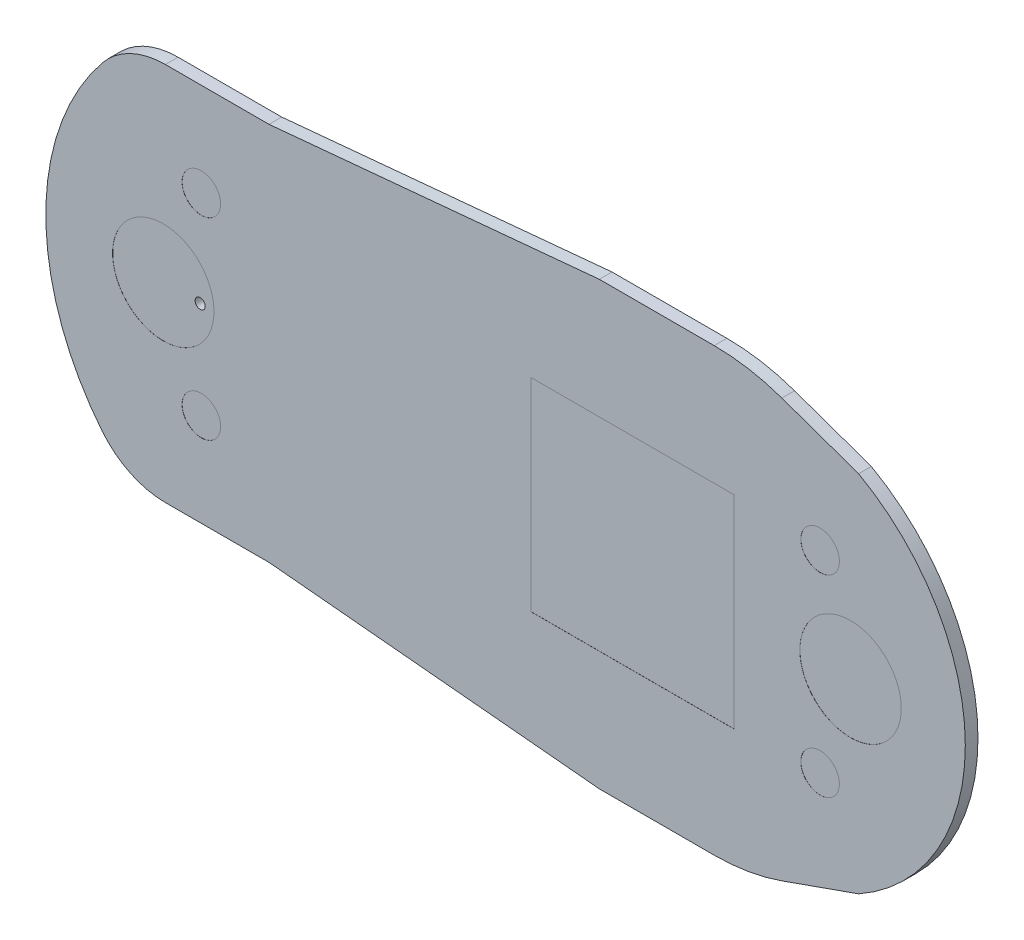
ISO-10303-21;
HEADER;
FILE_DESCRIPTION(('STEP AP214'),'2;1');
FILE_NAME('part.step','',(''),(''),'','','');
FILE_SCHEMA(('AUTOMOTIVE_DESIGN { 1 0 10303 214 1 1 1 1 }'));
ENDSEC;
DATA;
#1=APPLICATION_CONTEXT('core data for automotive mechanical design processes');
#2=APPLICATION_PROTOCOL_DEFINITION('international standard','automotive_design',2000,#1);
#3=PRODUCT_CONTEXT('',#1,'mechanical');
#4=PRODUCT('Part','Part','',(#3));
#5=PRODUCT_RELATED_PRODUCT_CATEGORY('part','',(#4));
#6=PRODUCT_DEFINITION_FORMATION('','',#4);
#7=PRODUCT_DEFINITION_CONTEXT('part definition',#1,'design');
#8=PRODUCT_DEFINITION('design','',#6,#7);
#9=PRODUCT_DEFINITION_SHAPE('','',#8);
#10=(LENGTH_UNIT() NAMED_UNIT(*) SI_UNIT(.MILLI.,.METRE.));
#11=(NAMED_UNIT(*) PLANE_ANGLE_UNIT() SI_UNIT($,.RADIAN.));
#12=(NAMED_UNIT(*) SI_UNIT($,.STERADIAN.) SOLID_ANGLE_UNIT());
#13=UNCERTAINTY_MEASURE_WITH_UNIT(LENGTH_MEASURE(1.E-05),#10,'distance_accuracy_value','');
#14=(GEOMETRIC_REPRESENTATION_CONTEXT(3) GLOBAL_UNCERTAINTY_ASSIGNED_CONTEXT((#13)) GLOBAL_UNIT_ASSIGNED_CONTEXT((#10,
#11,#12)) REPRESENTATION_CONTEXT('',''));
#15=CARTESIAN_POINT('',(0.,0.,0.));
#16=DIRECTION('',(0.,0.,1.));
#17=DIRECTION('',(1.,0.,0.));
#18=AXIS2_PLACEMENT_3D('',#15,#16,#17);
#19=CARTESIAN_POINT('',(122.626549398508,-30.4550148476976,-35.39998));
#20=DIRECTION('',(0.,0.,-1.));
#21=DIRECTION('',(-1.,0.,0.));
#22=AXIS2_PLACEMENT_3D('',#19,#20,#21);
#23=PLANE('',#22);
#24=CARTESIAN_POINT('',(-47.0985980295692,-27.1779998942306,-35.39998));
#25=DIRECTION('',(0.,0.,1.));
#26=DIRECTION('',(-1.,0.,0.));
#27=AXIS2_PLACEMENT_3D('',#24,#25,#26);
#28=CIRCLE('',#27,20.32);
#29=CARTESIAN_POINT('',(-62.8887002896557,-39.9676469032717,-35.39998));
#30=VERTEX_POINT('',#29);
#31=CARTESIAN_POINT('',(-47.0985980295692,-47.4979998942169,-35.39998));
#32=VERTEX_POINT('',#31);
#33=EDGE_CURVE('E188',#30,#32,#28,.T.);
#34=ORIENTED_EDGE('',*,*,#33,.F.);
#35=CARTESIAN_POINT('',(-13.5446307268799,-1.36631209144207E-11,-35.39998));
#36=DIRECTION('',(0.,0.,-1.));
#37=DIRECTION('',(-1.,0.,0.));
#38=AXIS2_PLACEMENT_3D('',#35,#36,#37);
#39=CIRCLE('',#38,63.5);
#40=CARTESIAN_POINT('',(-62.8887002896584,39.9676469032465,-35.39998));
#41=VERTEX_POINT('',#40);
#42=EDGE_CURVE('E201',#30,#41,#39,.T.);
#43=ORIENTED_EDGE('',*,*,#42,.T.);
#44=CARTESIAN_POINT('',(-47.0985980295693,27.1779998942033,-35.39998));
#45=DIRECTION('',(0.,0.,1.));
#46=DIRECTION('',(-1.,0.,0.));
#47=AXIS2_PLACEMENT_3D('',#44,#45,#46);
#48=CIRCLE('',#47,20.32);
#49=CARTESIAN_POINT('',(-47.0985980295693,47.4979998942033,-35.39998));
#50=VERTEX_POINT('',#49);
#51=EDGE_CURVE('E217',#50,#41,#48,.T.);
#52=ORIENTED_EDGE('',*,*,#51,.F.);
#53=DIRECTION('',(1.,0.,0.));
#54=VECTOR('',#53,1.);
#55=CARTESIAN_POINT('',(-48.895,47.4979998942169,-35.39998));
#56=LINE('',#55,#54);
#57=CARTESIAN_POINT('',(-21.1455,47.4979998942169,-35.39998));
#58=VERTEX_POINT('',#57);
#59=EDGE_CURVE('E270',#50,#58,#56,.T.);
#60=ORIENTED_EDGE('',*,*,#59,.T.);
#61=DIRECTION('',(0.995634568949673,0.0933370511233257,0.));
#62=VECTOR('',#61,1.);
#63=CARTESIAN_POINT('',(-4.5981853524393,49.0492493198395,-35.39998));
#64=LINE('',#63,#62);
#65=CARTESIAN_POINT('',(61.5582408342434,55.2511691061693,-35.39998));
#66=VERTEX_POINT('',#65);
#67=EDGE_CURVE('E264',#58,#66,#64,.T.);
#68=ORIENTED_EDGE('',*,*,#67,.T.);
#69=DIRECTION('',(1.,0.,0.));
#70=VECTOR('',#69,1.);
#71=CARTESIAN_POINT('',(61.5582408342434,55.2511691061693,-35.39998));
#72=LINE('',#71,#70);
#73=CARTESIAN_POINT('',(90.3291359160554,55.2511691061693,-35.39998));
#74=VERTEX_POINT('',#73);
#75=EDGE_CURVE('E348',#66,#74,#72,.T.);
#76=ORIENTED_EDGE('',*,*,#75,.T.);
#77=CARTESIAN_POINT('',(90.3291359160554,4.45116910615567,-35.39998));
#78=DIRECTION('',(0.,0.,1.));
#79=DIRECTION('',(-1.,0.,0.));
#80=AXIS2_PLACEMENT_3D('',#77,#78,#79);
#81=CIRCLE('',#80,50.8);
#82=CARTESIAN_POINT('',(107.258186289215,52.3473824581842,-35.39998));
#83=VERTEX_POINT('',#82);
#84=EDGE_CURVE('E76',#83,#74,#81,.T.);
#85=ORIENTED_EDGE('',*,*,#84,.F.);
#86=DIRECTION('',(0.942838845512373,-0.333249023093687,0.));
#87=VECTOR('',#86,1.);
#88=CARTESIAN_POINT('',(107.258186289215,52.3473824581842,-35.39998));
#89=LINE('',#88,#87);
#90=CARTESIAN_POINT('',(126.475317140702,45.5550338893877,-35.39998));
#91=VERTEX_POINT('',#90);
#92=EDGE_CURVE('E207',#83,#91,#89,.T.);
#93=ORIENTED_EDGE('',*,*,#92,.T.);
#94=CARTESIAN_POINT('',(101.009015662043,-1.35996332633924E-11,-35.39998));
#95=DIRECTION('',(0.,0.,-1.));
#96=DIRECTION('',(-1.,0.,0.));
#97=AXIS2_PLACEMENT_3D('',#94,#95,#96);
#98=CIRCLE('',#97,52.1899762757795);
#99=CARTESIAN_POINT('',(126.475317140702,-45.5550338894149,-35.39998));
#100=VERTEX_POINT('',#99);
#101=EDGE_CURVE('E402',#91,#100,#98,.T.);
#102=ORIENTED_EDGE('',*,*,#101,.T.);
#103=DIRECTION('',(-0.942838845512372,-0.333249023093688,0.));
#104=VECTOR('',#103,1.);
#105=CARTESIAN_POINT('',(126.475317140702,-45.5550338894149,-35.39998));
#106=LINE('',#105,#104);
#107=CARTESIAN_POINT('',(107.258186289215,-52.3473824582114,-35.39998));
#108=VERTEX_POINT('',#107);
#109=EDGE_CURVE('E375',#100,#108,#106,.T.);
#110=ORIENTED_EDGE('',*,*,#109,.T.);
#111=CARTESIAN_POINT('',(90.3291359160555,-4.45116910618289,-35.39998));
#112=DIRECTION('',(0.,0.,1.));
#113=DIRECTION('',(-1.,0.,0.));
#114=AXIS2_PLACEMENT_3D('',#111,#112,#113);
#115=CIRCLE('',#114,50.8);
#116=CARTESIAN_POINT('',(90.3291359160555,-55.2511691061829,-35.39998));
#117=VERTEX_POINT('',#116);
#118=EDGE_CURVE('E225',#117,#108,#115,.T.);
#119=ORIENTED_EDGE('',*,*,#118,.F.);
#120=DIRECTION('',(1.,0.,0.));
#121=VECTOR('',#120,1.);
#122=CARTESIAN_POINT('',(61.5582408342434,-55.2511691061693,-35.39998));
#123=LINE('',#122,#121);
#124=CARTESIAN_POINT('',(61.5582408342434,-55.2511691061693,-35.39998));
#125=VERTEX_POINT('',#124);
#126=EDGE_CURVE('E236',#125,#117,#123,.T.);
#127=ORIENTED_EDGE('',*,*,#126,.F.);
#128=DIRECTION('',(0.995634568949673,-0.0933370511233257,0.));
#129=VECTOR('',#128,1.);
#130=CARTESIAN_POINT('',(-4.5981853524393,-49.0492493198395,-35.39998));
#131=LINE('',#130,#129);
#132=CARTESIAN_POINT('',(-21.1455,-47.4979998942169,-35.39998));
#133=VERTEX_POINT('',#132);
#134=EDGE_CURVE('E258',#133,#125,#131,.T.);
#135=ORIENTED_EDGE('',*,*,#134,.F.);
#136=DIRECTION('',(1.,0.,0.));
#137=VECTOR('',#136,1.);
#138=CARTESIAN_POINT('',(-27.94,-47.4979998942169,-35.39998));
#139=LINE('',#138,#137);
#140=EDGE_CURVE('E275',#32,#133,#139,.T.);
#141=ORIENTED_EDGE('',*,*,#140,.F.);
#142=EDGE_LOOP('',(#34,#43,#52,#60,#68,#76,#85,#93,#102,#110,#119,#127,#135,#141));
#143=FACE_BOUND('',#142,.T.);
#144=ADVANCED_FACE('F52',(#143),#23,.T.);
#145=CARTESIAN_POINT('',(122.626549398508,-30.4550148476976,-32.22498));
#146=DIRECTION('',(0.,0.,-1.));
#147=DIRECTION('',(-1.,0.,0.));
#148=AXIS2_PLACEMENT_3D('',#145,#146,#147);
#149=PLANE('',#148);
#150=CARTESIAN_POINT('',(-13.5446307268799,-1.36631209144207E-11,-32.22498));
#151=DIRECTION('',(0.,0.,-1.));
#152=DIRECTION('',(-1.,0.,0.));
#153=AXIS2_PLACEMENT_3D('',#150,#151,#152);
#154=CIRCLE('',#153,63.5);
#155=CARTESIAN_POINT('',(-62.8887002896584,39.9676469032465,-32.22498));
#156=VERTEX_POINT('',#155);
#157=CARTESIAN_POINT('',(-62.8887002896557,-39.9676469032718,-32.22498));
#158=VERTEX_POINT('',#157);
#159=EDGE_CURVE('E191',#156,#158,#154,.F.);
#160=ORIENTED_EDGE('',*,*,#159,.T.);
#161=CARTESIAN_POINT('',(-47.0985980295692,-27.1779998942306,-32.22498));
#162=DIRECTION('',(0.,0.,1.));
#163=DIRECTION('',(-1.,0.,0.));
#164=AXIS2_PLACEMENT_3D('',#161,#162,#163);
#165=CIRCLE('',#164,20.32);
#166=CARTESIAN_POINT('',(-47.0985980295692,-47.4979998942306,-32.22498));
#167=VERTEX_POINT('',#166);
#168=EDGE_CURVE('E178',#158,#167,#165,.T.);
#169=ORIENTED_EDGE('',*,*,#168,.T.);
#170=DIRECTION('',(1.,0.,0.));
#171=VECTOR('',#170,1.);
#172=CARTESIAN_POINT('',(-27.94,-47.4979998942169,-32.22498));
#173=LINE('',#172,#171);
#174=CARTESIAN_POINT('',(-21.1455,-47.4979998942169,-32.22498));
#175=VERTEX_POINT('',#174);
#176=EDGE_CURVE('E259',#167,#175,#173,.T.);
#177=ORIENTED_EDGE('',*,*,#176,.T.);
#178=DIRECTION('',(0.995634568949673,-0.0933370511233257,0.));
#179=VECTOR('',#178,1.);
#180=CARTESIAN_POINT('',(-4.5981853524393,-49.0492493198395,-32.22498));
#181=LINE('',#180,#179);
#182=CARTESIAN_POINT('',(61.5582408342434,-55.2511691061693,-32.22498));
#183=VERTEX_POINT('',#182);
#184=EDGE_CURVE('E255',#175,#183,#181,.T.);
#185=ORIENTED_EDGE('',*,*,#184,.T.);
#186=DIRECTION('',(-1.,0.,0.));
#187=VECTOR('',#186,1.);
#188=CARTESIAN_POINT('',(61.5582408342434,-55.2511691061693,-32.22498));
#189=LINE('',#188,#187);
#190=CARTESIAN_POINT('',(90.3291359160555,-55.2511691061693,-32.22498));
#191=VERTEX_POINT('',#190);
#192=EDGE_CURVE('E61',#191,#183,#189,.T.);
#193=ORIENTED_EDGE('',*,*,#192,.F.);
#194=CARTESIAN_POINT('',(90.3291359160555,-4.45116910618289,-32.22498));
#195=DIRECTION('',(0.,0.,1.));
#196=DIRECTION('',(-1.,0.,0.));
#197=AXIS2_PLACEMENT_3D('',#194,#195,#196);
#198=CIRCLE('',#197,50.8);
#199=CARTESIAN_POINT('',(107.258186289215,-52.3473824582114,-32.22498));
#200=VERTEX_POINT('',#199);
#201=EDGE_CURVE('E68',#191,#200,#198,.T.);
#202=ORIENTED_EDGE('',*,*,#201,.T.);
#203=DIRECTION('',(0.942838845512372,0.333249023093688,0.));
#204=VECTOR('',#203,1.);
#205=CARTESIAN_POINT('',(126.475317140702,-45.5550338894149,-32.22498));
#206=LINE('',#205,#204);
#207=CARTESIAN_POINT('',(126.475317140702,-45.5550338894149,-32.22498));
#208=VERTEX_POINT('',#207);
#209=EDGE_CURVE('E383',#200,#208,#206,.T.);
#210=ORIENTED_EDGE('',*,*,#209,.T.);
#211=CARTESIAN_POINT('',(101.009015662043,-1.35996332633924E-11,-32.22498));
#212=DIRECTION('',(0.,0.,-1.));
#213=DIRECTION('',(-1.,0.,0.));
#214=AXIS2_PLACEMENT_3D('',#211,#212,#213);
#215=CIRCLE('',#214,52.1899762757795);
#216=CARTESIAN_POINT('',(126.475317140702,45.5550338893877,-32.22498));
#217=VERTEX_POINT('',#216);
#218=EDGE_CURVE('E384',#208,#217,#215,.F.);
#219=ORIENTED_EDGE('',*,*,#218,.T.);
#220=DIRECTION('',(-0.942838845512373,0.333249023093687,0.));
#221=VECTOR('',#220,1.);
#222=CARTESIAN_POINT('',(107.258186289215,52.3473824581842,-32.22498));
#223=LINE('',#222,#221);
#224=CARTESIAN_POINT('',(107.258186289215,52.3473824581842,-32.22498));
#225=VERTEX_POINT('',#224);
#226=EDGE_CURVE('E365',#217,#225,#223,.T.);
#227=ORIENTED_EDGE('',*,*,#226,.T.);
#228=CARTESIAN_POINT('',(90.3291359160554,4.45116910615567,-32.22498));
#229=DIRECTION('',(0.,0.,1.));
#230=DIRECTION('',(-1.,0.,0.));
#231=AXIS2_PLACEMENT_3D('',#228,#229,#230);
#232=CIRCLE('',#231,50.8);
#233=CARTESIAN_POINT('',(90.3291359160554,55.2511691061557,-32.22498));
#234=VERTEX_POINT('',#233);
#235=EDGE_CURVE('E361',#225,#234,#232,.T.);
#236=ORIENTED_EDGE('',*,*,#235,.T.);
#237=DIRECTION('',(-1.,0.,0.));
#238=VECTOR('',#237,1.);
#239=CARTESIAN_POINT('',(61.5582408342434,55.2511691061693,-32.22498));
#240=LINE('',#239,#238);
#241=CARTESIAN_POINT('',(61.5582408342434,55.2511691061693,-32.22498));
#242=VERTEX_POINT('',#241);
#243=EDGE_CURVE('E242',#234,#242,#240,.T.);
#244=ORIENTED_EDGE('',*,*,#243,.T.);
#245=DIRECTION('',(0.995634568949673,0.0933370511233257,0.));
#246=VECTOR('',#245,1.);
#247=CARTESIAN_POINT('',(-4.5981853524393,49.0492493198395,-32.22498));
#248=LINE('',#247,#246);
#249=CARTESIAN_POINT('',(-21.1455,47.4979998942169,-32.22498));
#250=VERTEX_POINT('',#249);
#251=EDGE_CURVE('E260',#250,#242,#248,.T.);
#252=ORIENTED_EDGE('',*,*,#251,.F.);
#253=DIRECTION('',(1.,0.,0.));
#254=VECTOR('',#253,1.);
#255=CARTESIAN_POINT('',(-48.895,47.4979998942169,-32.22498));
#256=LINE('',#255,#254);
#257=CARTESIAN_POINT('',(-47.0985980295693,47.4979998942169,-32.22498));
#258=VERTEX_POINT('',#257);
#259=EDGE_CURVE('E269',#258,#250,#256,.T.);
#260=ORIENTED_EDGE('',*,*,#259,.F.);
#261=CARTESIAN_POINT('',(-47.0985980295693,27.1779998942033,-32.22498));
#262=DIRECTION('',(0.,0.,1.));
#263=DIRECTION('',(-1.,0.,0.));
#264=AXIS2_PLACEMENT_3D('',#261,#262,#263);
#265=CIRCLE('',#264,20.32);
#266=EDGE_CURVE('E194',#258,#156,#265,.T.);
#267=ORIENTED_EDGE('',*,*,#266,.T.);
#268=EDGE_LOOP('',(#160,#169,#177,#185,#193,#202,#210,#219,#227,#236,#244,#252,#260,#267));
#269=FACE_BOUND('',#268,.T.);
#270=CARTESIAN_POINT('',(-38.1,24.13,-32.22498));
#271=DIRECTION('',(0.,0.,1.));
#272=DIRECTION('',(1.,0.,0.));
#273=AXIS2_PLACEMENT_3D('',#270,#271,#272);
#274=CIRCLE('',#273,4.82599999999999);
#275=CARTESIAN_POINT('',(-33.274,24.13,-32.22498));
#276=VERTEX_POINT('',#275);
#277=EDGE_CURVE('E296',#276,#276,#274,.T.);
#278=ORIENTED_EDGE('',*,*,#277,.F.);
#279=EDGE_LOOP('',(#278));
#280=FACE_BOUND('',#279,.T.);
#281=CARTESIAN_POINT('',(124.46,0.,-32.22498));
#282=DIRECTION('',(0.,0.,1.));
#283=DIRECTION('',(1.,0.,0.));
#284=AXIS2_PLACEMENT_3D('',#281,#282,#283);
#285=CIRCLE('',#284,12.7);
#286=CARTESIAN_POINT('',(137.16,0.,-32.22498));
#287=VERTEX_POINT('',#286);
#288=EDGE_CURVE('E288',#287,#287,#285,.T.);
#289=ORIENTED_EDGE('',*,*,#288,.F.);
#290=EDGE_LOOP('',(#289));
#291=FACE_BOUND('',#290,.T.);
#292=CARTESIAN_POINT('',(-47.625,0.,-32.22498));
#293=DIRECTION('',(0.,0.,1.));
#294=DIRECTION('',(1.,0.,0.));
#295=AXIS2_PLACEMENT_3D('',#292,#293,#294);
#296=CIRCLE('',#295,12.7);
#297=CARTESIAN_POINT('',(-34.925,0.,-32.22498));
#298=VERTEX_POINT('',#297);
#299=EDGE_CURVE('E281',#298,#298,#296,.T.);
#300=ORIENTED_EDGE('',*,*,#299,.F.);
#301=EDGE_LOOP('',(#300));
#302=FACE_BOUND('',#301,.T.);
#303=DIRECTION('',(-1.,0.,0.));
#304=VECTOR('',#303,1.);
#305=CARTESIAN_POINT('',(44.45,25.4,-32.22498));
#306=LINE('',#305,#304);
#307=CARTESIAN_POINT('',(95.25,25.4,-32.22498));
#308=VERTEX_POINT('',#307);
#309=CARTESIAN_POINT('',(44.45,25.4,-32.22498));
#310=VERTEX_POINT('',#309);
#311=EDGE_CURVE('E329',#308,#310,#306,.T.);
#312=ORIENTED_EDGE('',*,*,#311,.F.);
#313=DIRECTION('',(0.,1.,0.));
#314=VECTOR('',#313,1.);
#315=CARTESIAN_POINT('',(95.25,-25.4,-32.22498));
#316=LINE('',#315,#314);
#317=CARTESIAN_POINT('',(95.25,-25.4,-32.22498));
#318=VERTEX_POINT('',#317);
#319=EDGE_CURVE('E312',#318,#308,#316,.T.);
#320=ORIENTED_EDGE('',*,*,#319,.F.);
#321=DIRECTION('',(1.,0.,0.));
#322=VECTOR('',#321,1.);
#323=CARTESIAN_POINT('',(44.45,-25.4,-32.22498));
#324=LINE('',#323,#322);
#325=CARTESIAN_POINT('',(44.45,-25.4,-32.22498));
#326=VERTEX_POINT('',#325);
#327=EDGE_CURVE('E322',#326,#318,#324,.T.);
#328=ORIENTED_EDGE('',*,*,#327,.F.);
#329=DIRECTION('',(0.,-1.,0.));
#330=VECTOR('',#329,1.);
#331=CARTESIAN_POINT('',(44.45,-25.4,-32.22498));
#332=LINE('',#331,#330);
#333=EDGE_CURVE('E325',#310,#326,#332,.T.);
#334=ORIENTED_EDGE('',*,*,#333,.F.);
#335=EDGE_LOOP('',(#312,#320,#328,#334));
#336=FACE_BOUND('',#335,.T.);
#337=CARTESIAN_POINT('',(-38.1,-24.13,-32.22498));
#338=DIRECTION('',(0.,0.,1.));
#339=DIRECTION('',(-1.,0.,0.));
#340=AXIS2_PLACEMENT_3D('',#337,#338,#339);
#341=CIRCLE('',#340,4.82599999999999);
#342=CARTESIAN_POINT('',(-42.926,-24.13,-32.22498));
#343=VERTEX_POINT('',#342);
#344=EDGE_CURVE('E306',#343,#343,#341,.T.);
#345=ORIENTED_EDGE('',*,*,#344,.F.);
#346=EDGE_LOOP('',(#345));
#347=FACE_BOUND('',#346,.T.);
#348=CARTESIAN_POINT('',(116.84,-24.13,-32.22498));
#349=DIRECTION('',(0.,0.,1.));
#350=DIRECTION('',(-1.,0.,0.));
#351=AXIS2_PLACEMENT_3D('',#348,#349,#350);
#352=CIRCLE('',#351,4.82599999999999);
#353=CARTESIAN_POINT('',(112.014,-24.13,-32.22498));
#354=VERTEX_POINT('',#353);
#355=EDGE_CURVE('E300',#354,#354,#352,.T.);
#356=ORIENTED_EDGE('',*,*,#355,.F.);
#357=EDGE_LOOP('',(#356));
#358=FACE_BOUND('',#357,.T.);
#359=CARTESIAN_POINT('',(116.84,24.13,-32.22498));
#360=DIRECTION('',(0.,0.,1.));
#361=DIRECTION('',(1.,0.,0.));
#362=AXIS2_PLACEMENT_3D('',#359,#360,#361);
#363=CIRCLE('',#362,4.82599999999999);
#364=CARTESIAN_POINT('',(121.666,24.13,-32.22498));
#365=VERTEX_POINT('',#364);
#366=EDGE_CURVE('E293',#365,#365,#363,.T.);
#367=ORIENTED_EDGE('',*,*,#366,.F.);
#368=EDGE_LOOP('',(#367));
#369=FACE_BOUND('',#368,.T.);
#370=ADVANCED_FACE('F54',(#269,#280,#291,#302,#336,#347,#358,#369),#149,.F.);
#371=CARTESIAN_POINT('',(61.5582408342434,-55.2511691061693,9.23690671004311));
#372=DIRECTION('',(0.,1.,0.));
#373=DIRECTION('',(0.,0.,1.));
#374=AXIS2_PLACEMENT_3D('',#371,#372,#373);
#375=PLANE('',#374);
#376=ORIENTED_EDGE('',*,*,#126,.T.);
#377=DIRECTION('',(0.,0.,-1.));
#378=VECTOR('',#377,1.);
#379=CARTESIAN_POINT('',(90.3291359160555,-55.2511691061829,-32.22498));
#380=LINE('',#379,#378);
#381=EDGE_CURVE('E223',#191,#117,#380,.T.);
#382=ORIENTED_EDGE('',*,*,#381,.F.);
#383=ORIENTED_EDGE('',*,*,#192,.T.);
#384=DIRECTION('',(0.,0.,-1.));
#385=VECTOR('',#384,1.);
#386=CARTESIAN_POINT('',(61.5582408342434,-55.2511691061693,9.23690671004311));
#387=LINE('',#386,#385);
#388=EDGE_CURVE('E241',#183,#125,#387,.T.);
#389=ORIENTED_EDGE('',*,*,#388,.T.);
#390=EDGE_LOOP('',(#376,#382,#383,#389));
#391=FACE_BOUND('',#390,.T.);
#392=ADVANCED_FACE('F249',(#391),#375,.F.);
#393=CARTESIAN_POINT('',(61.5582408342434,55.2511691061693,9.23690671004311));
#394=DIRECTION('',(0.,1.,0.));
#395=DIRECTION('',(0.,0.,1.));
#396=AXIS2_PLACEMENT_3D('',#393,#394,#395);
#397=PLANE('',#396);
#398=DIRECTION('',(0.,0.,-1.));
#399=VECTOR('',#398,1.);
#400=CARTESIAN_POINT('',(90.3291359160554,55.2511691061557,-32.22498));
#401=LINE('',#400,#399);
#402=EDGE_CURVE('E363',#234,#74,#401,.T.);
#403=ORIENTED_EDGE('',*,*,#402,.T.);
#404=ORIENTED_EDGE('',*,*,#75,.F.);
#405=DIRECTION('',(0.,0.,-1.));
#406=VECTOR('',#405,1.);
#407=CARTESIAN_POINT('',(61.5582408342434,55.2511691061693,9.23690671004311));
#408=LINE('',#407,#406);
#409=EDGE_CURVE('E352',#242,#66,#408,.T.);
#410=ORIENTED_EDGE('',*,*,#409,.F.);
#411=ORIENTED_EDGE('',*,*,#243,.F.);
#412=EDGE_LOOP('',(#403,#404,#410,#411));
#413=FACE_BOUND('',#412,.T.);
#414=ADVANCED_FACE('F416',(#413),#397,.T.);
#415=CARTESIAN_POINT('',(-38.1,24.13,-32.25038));
#416=DIRECTION('',(0.,0.,1.));
#417=DIRECTION('',(1.,0.,0.));
#418=AXIS2_PLACEMENT_3D('',#415,#416,#417);
#419=CYLINDRICAL_SURFACE('',#418,4.82599999999999);
#420=CARTESIAN_POINT('',(-38.1,24.13,-32.25038));
#421=DIRECTION('',(0.,0.,1.));
#422=DIRECTION('',(1.,0.,0.));
#423=AXIS2_PLACEMENT_3D('',#420,#421,#422);
#424=CIRCLE('',#423,4.82599999999999);
#425=CARTESIAN_POINT('',(-33.274,24.13,-32.25038));
#426=VERTEX_POINT('',#425);
#427=EDGE_CURVE('E343',#426,#426,#424,.T.);
#428=ORIENTED_EDGE('',*,*,#427,.F.);
#429=EDGE_LOOP('',(#428));
#430=FACE_BOUND('',#429,.T.);
#431=ORIENTED_EDGE('',*,*,#277,.T.);
#432=EDGE_LOOP('',(#431));
#433=FACE_BOUND('',#432,.T.);
#434=ADVANCED_FACE('F457',(#430,#433),#419,.F.);
#435=CARTESIAN_POINT('',(-38.1,24.13,-32.25038));
#436=DIRECTION('',(0.,0.,1.));
#437=DIRECTION('',(1.,0.,0.));
#438=AXIS2_PLACEMENT_3D('',#435,#436,#437);
#439=PLANE('',#438);
#440=ORIENTED_EDGE('',*,*,#427,.T.);
#441=EDGE_LOOP('',(#440));
#442=FACE_BOUND('',#441,.T.);
#443=ADVANCED_FACE('F460',(#442),#439,.T.);
#444=CARTESIAN_POINT('',(124.46,0.,-32.25038));
#445=DIRECTION('',(0.,0.,1.));
#446=DIRECTION('',(1.,0.,0.));
#447=AXIS2_PLACEMENT_3D('',#444,#445,#446);
#448=CYLINDRICAL_SURFACE('',#447,12.7);
#449=CARTESIAN_POINT('',(124.46,0.,-32.25038));
#450=DIRECTION('',(0.,0.,1.));
#451=DIRECTION('',(1.,0.,0.));
#452=AXIS2_PLACEMENT_3D('',#449,#450,#451);
#453=CIRCLE('',#452,12.7);
#454=CARTESIAN_POINT('',(137.16,0.,-32.25038));
#455=VERTEX_POINT('',#454);
#456=EDGE_CURVE('E280',#455,#455,#453,.T.);
#457=ORIENTED_EDGE('',*,*,#456,.F.);
#458=EDGE_LOOP('',(#457));
#459=FACE_BOUND('',#458,.T.);
#460=ORIENTED_EDGE('',*,*,#288,.T.);
#461=EDGE_LOOP('',(#460));
#462=FACE_BOUND('',#461,.T.);
#463=ADVANCED_FACE('F464',(#459,#462),#448,.F.);
#464=CARTESIAN_POINT('',(124.46,0.,-32.25038));
#465=DIRECTION('',(0.,0.,1.));
#466=DIRECTION('',(1.,0.,0.));
#467=AXIS2_PLACEMENT_3D('',#464,#465,#466);
#468=PLANE('',#467);
#469=ORIENTED_EDGE('',*,*,#456,.T.);
#470=EDGE_LOOP('',(#469));
#471=FACE_BOUND('',#470,.T.);
#472=ADVANCED_FACE('F510',(#471),#468,.T.);
#473=CARTESIAN_POINT('',(-47.625,0.,-32.25038));
#474=DIRECTION('',(0.,0.,1.));
#475=DIRECTION('',(1.,0.,0.));
#476=AXIS2_PLACEMENT_3D('',#473,#474,#475);
#477=PLANE('',#476);
#478=CARTESIAN_POINT('',(-47.625,0.,-32.25038));
#479=DIRECTION('',(0.,0.,1.));
#480=DIRECTION('',(1.,0.,0.));
#481=AXIS2_PLACEMENT_3D('',#478,#479,#480);
#482=CIRCLE('',#481,12.7);
#483=CARTESIAN_POINT('',(-34.925,0.,-32.25038));
#484=VERTEX_POINT('',#483);
#485=EDGE_CURVE('E285',#484,#484,#482,.T.);
#486=ORIENTED_EDGE('',*,*,#485,.T.);
#487=EDGE_LOOP('',(#486));
#488=FACE_BOUND('',#487,.T.);
#489=CARTESIAN_POINT('',(-38.4175,0.,-32.25038));
#490=DIRECTION('',(0.,0.,1.));
#491=DIRECTION('',(1.,0.,0.));
#492=AXIS2_PLACEMENT_3D('',#489,#490,#491);
#493=CIRCLE('',#492,1.27);
#494=CARTESIAN_POINT('',(-37.1475,0.,-32.25038));
#495=VERTEX_POINT('',#494);
#496=EDGE_CURVE('E56',#495,#495,#493,.F.);
#497=ORIENTED_EDGE('',*,*,#496,.T.);
#498=EDGE_LOOP('',(#497));
#499=FACE_BOUND('',#498,.T.);
#500=ADVANCED_FACE('F513',(#488,#499),#477,.T.);
#501=CARTESIAN_POINT('',(-47.625,0.,-32.25038));
#502=DIRECTION('',(0.,0.,1.));
#503=DIRECTION('',(1.,0.,0.));
#504=AXIS2_PLACEMENT_3D('',#501,#502,#503);
#505=CYLINDRICAL_SURFACE('',#504,12.7);
#506=ORIENTED_EDGE('',*,*,#485,.F.);
#507=EDGE_LOOP('',(#506));
#508=FACE_BOUND('',#507,.T.);
#509=ORIENTED_EDGE('',*,*,#299,.T.);
#510=EDGE_LOOP('',(#509));
#511=FACE_BOUND('',#510,.T.);
#512=ADVANCED_FACE('F486',(#508,#511),#505,.F.);
#513=CARTESIAN_POINT('',(95.25,-25.4,-32.25038));
#514=DIRECTION('',(1.,0.,0.));
#515=DIRECTION('',(0.,0.,-1.));
#516=AXIS2_PLACEMENT_3D('',#513,#514,#515);
#517=PLANE('',#516);
#518=ORIENTED_EDGE('',*,*,#319,.T.);
#519=DIRECTION('',(0.,0.,1.));
#520=VECTOR('',#519,1.);
#521=CARTESIAN_POINT('',(95.25,25.4,-32.25038));
#522=LINE('',#521,#520);
#523=CARTESIAN_POINT('',(95.25,25.4,-32.25038));
#524=VERTEX_POINT('',#523);
#525=EDGE_CURVE('E313',#524,#308,#522,.T.);
#526=ORIENTED_EDGE('',*,*,#525,.F.);
#527=DIRECTION('',(0.,1.,0.));
#528=VECTOR('',#527,1.);
#529=CARTESIAN_POINT('',(95.25,-25.4,-32.25038));
#530=LINE('',#529,#528);
#531=CARTESIAN_POINT('',(95.25,-25.4,-32.25038));
#532=VERTEX_POINT('',#531);
#533=EDGE_CURVE('E326',#532,#524,#530,.T.);
#534=ORIENTED_EDGE('',*,*,#533,.F.);
#535=DIRECTION('',(0.,0.,1.));
#536=VECTOR('',#535,1.);
#537=CARTESIAN_POINT('',(95.25,-25.4,-32.25038));
#538=LINE('',#537,#536);
#539=EDGE_CURVE('E284',#532,#318,#538,.T.);
#540=ORIENTED_EDGE('',*,*,#539,.T.);
#541=EDGE_LOOP('',(#518,#526,#534,#540));
#542=FACE_BOUND('',#541,.T.);
#543=ADVANCED_FACE('F476',(#542),#517,.F.);
#544=CARTESIAN_POINT('',(44.45,-25.4,-32.25038));
#545=DIRECTION('',(0.,-1.,0.));
#546=DIRECTION('',(1.,0.,0.));
#547=AXIS2_PLACEMENT_3D('',#544,#545,#546);
#548=PLANE('',#547);
#549=ORIENTED_EDGE('',*,*,#327,.T.);
#550=ORIENTED_EDGE('',*,*,#539,.F.);
#551=DIRECTION('',(1.,0.,0.));
#552=VECTOR('',#551,1.);
#553=CARTESIAN_POINT('',(44.45,-25.4,-32.25038));
#554=LINE('',#553,#552);
#555=CARTESIAN_POINT('',(44.45,-25.4,-32.25038));
#556=VERTEX_POINT('',#555);
#557=EDGE_CURVE('E316',#556,#532,#554,.T.);
#558=ORIENTED_EDGE('',*,*,#557,.F.);
#559=DIRECTION('',(0.,0.,1.));
#560=VECTOR('',#559,1.);
#561=CARTESIAN_POINT('',(44.45,-25.4,-32.25038));
#562=LINE('',#561,#560);
#563=EDGE_CURVE('E319',#556,#326,#562,.T.);
#564=ORIENTED_EDGE('',*,*,#563,.T.);
#565=EDGE_LOOP('',(#549,#550,#558,#564));
#566=FACE_BOUND('',#565,.T.);
#567=ADVANCED_FACE('F472',(#566),#548,.F.);
#568=CARTESIAN_POINT('',(44.45,-25.4,-32.25038));
#569=DIRECTION('',(-1.,0.,0.));
#570=DIRECTION('',(0.,0.,1.));
#571=AXIS2_PLACEMENT_3D('',#568,#569,#570);
#572=PLANE('',#571);
#573=ORIENTED_EDGE('',*,*,#333,.T.);
#574=ORIENTED_EDGE('',*,*,#563,.F.);
#575=DIRECTION('',(0.,-1.,0.));
#576=VECTOR('',#575,1.);
#577=CARTESIAN_POINT('',(44.45,-25.4,-32.25038));
#578=LINE('',#577,#576);
#579=CARTESIAN_POINT('',(44.45,25.4,-32.25038));
#580=VERTEX_POINT('',#579);
#581=EDGE_CURVE('E335',#580,#556,#578,.T.);
#582=ORIENTED_EDGE('',*,*,#581,.F.);
#583=DIRECTION('',(0.,0.,1.));
#584=VECTOR('',#583,1.);
#585=CARTESIAN_POINT('',(44.45,25.4,-32.25038));
#586=LINE('',#585,#584);
#587=EDGE_CURVE('E317',#580,#310,#586,.T.);
#588=ORIENTED_EDGE('',*,*,#587,.T.);
#589=EDGE_LOOP('',(#573,#574,#582,#588));
#590=FACE_BOUND('',#589,.T.);
#591=ADVANCED_FACE('F475',(#590),#572,.F.);
#592=CARTESIAN_POINT('',(44.45,25.4,-32.25038));
#593=DIRECTION('',(0.,1.,0.));
#594=DIRECTION('',(0.,0.,1.));
#595=AXIS2_PLACEMENT_3D('',#592,#593,#594);
#596=PLANE('',#595);
#597=ORIENTED_EDGE('',*,*,#311,.T.);
#598=ORIENTED_EDGE('',*,*,#587,.F.);
#599=DIRECTION('',(-1.,0.,0.));
#600=VECTOR('',#599,1.);
#601=CARTESIAN_POINT('',(44.45,25.4,-32.25038));
#602=LINE('',#601,#600);
#603=EDGE_CURVE('E338',#524,#580,#602,.T.);
#604=ORIENTED_EDGE('',*,*,#603,.F.);
#605=ORIENTED_EDGE('',*,*,#525,.T.);
#606=EDGE_LOOP('',(#597,#598,#604,#605));
#607=FACE_BOUND('',#606,.T.);
#608=ADVANCED_FACE('F470',(#607),#596,.F.);
#609=CARTESIAN_POINT('',(0.,0.,-32.25038));
#610=DIRECTION('',(0.,0.,-1.));
#611=DIRECTION('',(-1.,0.,0.));
#612=AXIS2_PLACEMENT_3D('',#609,#610,#611);
#613=PLANE('',#612);
#614=ORIENTED_EDGE('',*,*,#533,.T.);
#615=ORIENTED_EDGE('',*,*,#603,.T.);
#616=ORIENTED_EDGE('',*,*,#581,.T.);
#617=ORIENTED_EDGE('',*,*,#557,.T.);
#618=EDGE_LOOP('',(#614,#615,#616,#617));
#619=FACE_BOUND('',#618,.T.);
#620=ADVANCED_FACE('F466',(#619),#613,.F.);
#621=CARTESIAN_POINT('',(-38.1,-24.13,-32.25038));
#622=DIRECTION('',(0.,0.,1.));
#623=DIRECTION('',(1.,0.,0.));
#624=AXIS2_PLACEMENT_3D('',#621,#622,#623);
#625=CYLINDRICAL_SURFACE('',#624,4.82599999999999);
#626=CARTESIAN_POINT('',(-38.1,-24.13,-32.25038));
#627=DIRECTION('',(0.,0.,1.));
#628=DIRECTION('',(-1.,0.,0.));
#629=AXIS2_PLACEMENT_3D('',#626,#627,#628);
#630=CIRCLE('',#629,4.82599999999999);
#631=CARTESIAN_POINT('',(-42.926,-24.13,-32.25038));
#632=VERTEX_POINT('',#631);
#633=EDGE_CURVE('E309',#632,#632,#630,.T.);
#634=ORIENTED_EDGE('',*,*,#633,.F.);
#635=EDGE_LOOP('',(#634));
#636=FACE_BOUND('',#635,.T.);
#637=ORIENTED_EDGE('',*,*,#344,.T.);
#638=EDGE_LOOP('',(#637));
#639=FACE_BOUND('',#638,.T.);
#640=ADVANCED_FACE('F469',(#636,#639),#625,.F.);
#641=CARTESIAN_POINT('',(-38.1,-24.13,-32.25038));
#642=DIRECTION('',(0.,0.,-1.));
#643=DIRECTION('',(-1.,0.,0.));
#644=AXIS2_PLACEMENT_3D('',#641,#642,#643);
#645=PLANE('',#644);
#646=ORIENTED_EDGE('',*,*,#633,.T.);
#647=EDGE_LOOP('',(#646));
#648=FACE_BOUND('',#647,.T.);
#649=ADVANCED_FACE('F488',(#648),#645,.F.);
#650=CARTESIAN_POINT('',(116.84,-24.13,-32.25038));
#651=DIRECTION('',(0.,0.,1.));
#652=DIRECTION('',(1.,0.,0.));
#653=AXIS2_PLACEMENT_3D('',#650,#651,#652);
#654=CYLINDRICAL_SURFACE('',#653,4.82599999999999);
#655=CARTESIAN_POINT('',(116.84,-24.13,-32.25038));
#656=DIRECTION('',(0.,0.,1.));
#657=DIRECTION('',(-1.,0.,0.));
#658=AXIS2_PLACEMENT_3D('',#655,#656,#657);
#659=CIRCLE('',#658,4.82599999999999);
#660=CARTESIAN_POINT('',(112.014,-24.13,-32.25038));
#661=VERTEX_POINT('',#660);
#662=EDGE_CURVE('E303',#661,#661,#659,.T.);
#663=ORIENTED_EDGE('',*,*,#662,.F.);
#664=EDGE_LOOP('',(#663));
#665=FACE_BOUND('',#664,.T.);
#666=ORIENTED_EDGE('',*,*,#355,.T.);
#667=EDGE_LOOP('',(#666));
#668=FACE_BOUND('',#667,.T.);
#669=ADVANCED_FACE('F491',(#665,#668),#654,.F.);
#670=CARTESIAN_POINT('',(116.84,-24.13,-32.25038));
#671=DIRECTION('',(0.,0.,-1.));
#672=DIRECTION('',(-1.,0.,0.));
#673=AXIS2_PLACEMENT_3D('',#670,#671,#672);
#674=PLANE('',#673);
#675=ORIENTED_EDGE('',*,*,#662,.T.);
#676=EDGE_LOOP('',(#675));
#677=FACE_BOUND('',#676,.T.);
#678=ADVANCED_FACE('F496',(#677),#674,.F.);
#679=CARTESIAN_POINT('',(116.84,24.13,-32.25038));
#680=DIRECTION('',(0.,0.,1.));
#681=DIRECTION('',(1.,0.,0.));
#682=AXIS2_PLACEMENT_3D('',#679,#680,#681);
#683=CYLINDRICAL_SURFACE('',#682,4.82599999999999);
#684=CARTESIAN_POINT('',(116.84,24.13,-32.25038));
#685=DIRECTION('',(0.,0.,1.));
#686=DIRECTION('',(1.,0.,0.));
#687=AXIS2_PLACEMENT_3D('',#684,#685,#686);
#688=CIRCLE('',#687,4.82599999999999);
#689=CARTESIAN_POINT('',(121.666,24.13,-32.25038));
#690=VERTEX_POINT('',#689);
#691=EDGE_CURVE('E297',#690,#690,#688,.T.);
#692=ORIENTED_EDGE('',*,*,#691,.F.);
#693=EDGE_LOOP('',(#692));
#694=FACE_BOUND('',#693,.T.);
#695=ORIENTED_EDGE('',*,*,#366,.T.);
#696=EDGE_LOOP('',(#695));
#697=FACE_BOUND('',#696,.T.);
#698=ADVANCED_FACE('F499',(#694,#697),#683,.F.);
#699=CARTESIAN_POINT('',(116.84,24.13,-32.25038));
#700=DIRECTION('',(0.,0.,1.));
#701=DIRECTION('',(1.,0.,0.));
#702=AXIS2_PLACEMENT_3D('',#699,#700,#701);
#703=PLANE('',#702);
#704=ORIENTED_EDGE('',*,*,#691,.T.);
#705=EDGE_LOOP('',(#704));
#706=FACE_BOUND('',#705,.T.);
#707=ADVANCED_FACE('F451',(#706),#703,.T.);
#708=CARTESIAN_POINT('',(-47.625,0.,-35.37458));
#709=DIRECTION('',(0.,0.,-1.));
#710=DIRECTION('',(-1.,0.,0.));
#711=AXIS2_PLACEMENT_3D('',#708,#709,#710);
#712=PLANE('',#711);
#713=CARTESIAN_POINT('',(-38.4175,0.,-35.37458));
#714=DIRECTION('',(0.,0.,-1.));
#715=DIRECTION('',(-1.,0.,0.));
#716=AXIS2_PLACEMENT_3D('',#713,#714,#715);
#717=CIRCLE('',#716,1.27);
#718=CARTESIAN_POINT('',(-39.6875,0.,-35.37458));
#719=VERTEX_POINT('',#718);
#720=EDGE_CURVE('E12',#719,#719,#717,.F.);
#721=ORIENTED_EDGE('',*,*,#720,.T.);
#722=EDGE_LOOP('',(#721));
#723=FACE_BOUND('',#722,.T.);
#724=ADVANCED_FACE('F447',(#723),#712,.F.);
#725=CARTESIAN_POINT('',(-38.4175,0.,-35.4091453552246));
#726=DIRECTION('',(0.,0.,1.));
#727=DIRECTION('',(1.,0.,0.));
#728=AXIS2_PLACEMENT_3D('',#725,#726,#727);
#729=CYLINDRICAL_SURFACE('',#728,1.27);
#730=ORIENTED_EDGE('',*,*,#720,.F.);
#731=EDGE_LOOP('',(#730));
#732=FACE_BOUND('',#731,.T.);
#733=ORIENTED_EDGE('',*,*,#496,.F.);
#734=EDGE_LOOP('',(#733));
#735=FACE_BOUND('',#734,.T.);
#736=ADVANCED_FACE('F444',(#732,#735),#729,.F.);
#737=CARTESIAN_POINT('',(-27.94,-47.4979998942169,-82.6439795979666));
#738=DIRECTION('',(0.,-1.,0.));
#739=DIRECTION('',(1.,0.,0.));
#740=AXIS2_PLACEMENT_3D('',#737,#738,#739);
#741=PLANE('',#740);
#742=DIRECTION('',(0.,0.,-1.));
#743=VECTOR('',#742,1.);
#744=CARTESIAN_POINT('',(-47.0985980295692,-47.4979998942306,-32.22498));
#745=LINE('',#744,#743);
#746=EDGE_CURVE('E185',#167,#32,#745,.T.);
#747=ORIENTED_EDGE('',*,*,#746,.T.);
#748=ORIENTED_EDGE('',*,*,#140,.T.);
#749=DIRECTION('',(0.,0.,1.));
#750=VECTOR('',#749,1.);
#751=CARTESIAN_POINT('',(-21.1455,-47.4979998942169,-82.6439795979666));
#752=LINE('',#751,#750);
#753=EDGE_CURVE('E278',#133,#175,#752,.T.);
#754=ORIENTED_EDGE('',*,*,#753,.T.);
#755=ORIENTED_EDGE('',*,*,#176,.F.);
#756=EDGE_LOOP('',(#747,#748,#754,#755));
#757=FACE_BOUND('',#756,.T.);
#758=ADVANCED_FACE('F370',(#757),#741,.T.);
#759=CARTESIAN_POINT('',(-48.895,47.4979998942169,-82.6439795979666));
#760=DIRECTION('',(0.,-1.,0.));
#761=DIRECTION('',(1.,0.,0.));
#762=AXIS2_PLACEMENT_3D('',#759,#760,#761);
#763=PLANE('',#762);
#764=ORIENTED_EDGE('',*,*,#59,.F.);
#765=DIRECTION('',(0.,0.,-1.));
#766=VECTOR('',#765,1.);
#767=CARTESIAN_POINT('',(-47.0985980295693,47.4979998942033,-32.22498));
#768=LINE('',#767,#766);
#769=EDGE_CURVE('E221',#258,#50,#768,.T.);
#770=ORIENTED_EDGE('',*,*,#769,.F.);
#771=ORIENTED_EDGE('',*,*,#259,.T.);
#772=DIRECTION('',(0.,0.,1.));
#773=VECTOR('',#772,1.);
#774=CARTESIAN_POINT('',(-21.1455,47.4979998942169,-82.6439795979666));
#775=LINE('',#774,#773);
#776=EDGE_CURVE('E262',#58,#250,#775,.T.);
#777=ORIENTED_EDGE('',*,*,#776,.F.);
#778=EDGE_LOOP('',(#764,#770,#771,#777));
#779=FACE_BOUND('',#778,.T.);
#780=ADVANCED_FACE('F426',(#779),#763,.F.);
#781=CARTESIAN_POINT('',(-4.5981853524393,-49.0492493198395,-122.16020814845));
#782=DIRECTION('',(-0.0933370511233257,-0.995634568949673,0.));
#783=DIRECTION('',(0.995634568949673,-0.0933370511233257,0.));
#784=AXIS2_PLACEMENT_3D('',#781,#782,#783);
#785=PLANE('',#784);
#786=ORIENTED_EDGE('',*,*,#753,.F.);
#787=ORIENTED_EDGE('',*,*,#134,.T.);
#788=ORIENTED_EDGE('',*,*,#388,.F.);
#789=ORIENTED_EDGE('',*,*,#184,.F.);
#790=EDGE_LOOP('',(#786,#787,#788,#789));
#791=FACE_BOUND('',#790,.T.);
#792=ADVANCED_FACE('F254',(#791),#785,.T.);
#793=CARTESIAN_POINT('',(-4.5981853524393,49.0492493198395,-122.16020814845));
#794=DIRECTION('',(0.0933370511233257,-0.995634568949673,0.));
#795=DIRECTION('',(0.995634568949673,0.0933370511233257,0.));
#796=AXIS2_PLACEMENT_3D('',#793,#794,#795);
#797=PLANE('',#796);
#798=ORIENTED_EDGE('',*,*,#67,.F.);
#799=ORIENTED_EDGE('',*,*,#776,.T.);
#800=ORIENTED_EDGE('',*,*,#251,.T.);
#801=ORIENTED_EDGE('',*,*,#409,.T.);
#802=EDGE_LOOP('',(#798,#799,#800,#801));
#803=FACE_BOUND('',#802,.T.);
#804=ADVANCED_FACE('F420',(#803),#797,.F.);
#805=CARTESIAN_POINT('',(-47.0985980295693,27.1779998942033,-32.22498));
#806=DIRECTION('',(0.,0.,-1.));
#807=DIRECTION('',(-1.,0.,0.));
#808=AXIS2_PLACEMENT_3D('',#805,#806,#807);
#809=CYLINDRICAL_SURFACE('',#808,20.32);
#810=ORIENTED_EDGE('',*,*,#51,.T.);
#811=DIRECTION('',(0.,0.,-1.));
#812=VECTOR('',#811,1.);
#813=CARTESIAN_POINT('',(-62.8887002896584,39.9676469032465,90.8815683947523));
#814=LINE('',#813,#812);
#815=EDGE_CURVE('E202',#156,#41,#814,.T.);
#816=ORIENTED_EDGE('',*,*,#815,.F.);
#817=ORIENTED_EDGE('',*,*,#266,.F.);
#818=ORIENTED_EDGE('',*,*,#769,.T.);
#819=EDGE_LOOP('',(#810,#816,#817,#818));
#820=FACE_BOUND('',#819,.T.);
#821=ADVANCED_FACE('F429',(#820),#809,.T.);
#822=CARTESIAN_POINT('',(-47.0985980295692,-27.1779998942306,-32.22498));
#823=DIRECTION('',(0.,0.,-1.));
#824=DIRECTION('',(-1.,0.,0.));
#825=AXIS2_PLACEMENT_3D('',#822,#823,#824);
#826=CYLINDRICAL_SURFACE('',#825,20.32);
#827=ORIENTED_EDGE('',*,*,#33,.T.);
#828=ORIENTED_EDGE('',*,*,#746,.F.);
#829=ORIENTED_EDGE('',*,*,#168,.F.);
#830=DIRECTION('',(0.,0.,-1.));
#831=VECTOR('',#830,1.);
#832=CARTESIAN_POINT('',(-62.8887002896557,-39.9676469032717,90.8815683947523));
#833=LINE('',#832,#831);
#834=EDGE_CURVE('E182',#158,#30,#833,.T.);
#835=ORIENTED_EDGE('',*,*,#834,.T.);
#836=EDGE_LOOP('',(#827,#828,#829,#835));
#837=FACE_BOUND('',#836,.T.);
#838=ADVANCED_FACE('F180',(#837),#826,.T.);
#839=CARTESIAN_POINT('',(90.3291359160554,4.45116910615567,-32.22498));
#840=DIRECTION('',(0.,0.,-1.));
#841=DIRECTION('',(-1.,0.,0.));
#842=AXIS2_PLACEMENT_3D('',#839,#840,#841);
#843=CYLINDRICAL_SURFACE('',#842,50.8);
#844=ORIENTED_EDGE('',*,*,#84,.T.);
#845=ORIENTED_EDGE('',*,*,#402,.F.);
#846=ORIENTED_EDGE('',*,*,#235,.F.);
#847=DIRECTION('',(0.,0.,-1.));
#848=VECTOR('',#847,1.);
#849=CARTESIAN_POINT('',(107.258186289215,52.3473824581842,90.8815683947523));
#850=LINE('',#849,#848);
#851=EDGE_CURVE('E393',#225,#83,#850,.T.);
#852=ORIENTED_EDGE('',*,*,#851,.T.);
#853=EDGE_LOOP('',(#844,#845,#846,#852));
#854=FACE_BOUND('',#853,.T.);
#855=ADVANCED_FACE('F411',(#854),#843,.T.);
#856=CARTESIAN_POINT('',(90.3291359160555,-4.45116910618289,-32.22498));
#857=DIRECTION('',(0.,0.,-1.));
#858=DIRECTION('',(-1.,0.,0.));
#859=AXIS2_PLACEMENT_3D('',#856,#857,#858);
#860=CYLINDRICAL_SURFACE('',#859,50.8);
#861=ORIENTED_EDGE('',*,*,#118,.T.);
#862=DIRECTION('',(0.,0.,-1.));
#863=VECTOR('',#862,1.);
#864=CARTESIAN_POINT('',(107.258186289215,-52.3473824582114,90.8815683947523));
#865=LINE('',#864,#863);
#866=EDGE_CURVE('E378',#200,#108,#865,.T.);
#867=ORIENTED_EDGE('',*,*,#866,.F.);
#868=ORIENTED_EDGE('',*,*,#201,.F.);
#869=ORIENTED_EDGE('',*,*,#381,.T.);
#870=EDGE_LOOP('',(#861,#867,#868,#869));
#871=FACE_BOUND('',#870,.T.);
#872=ADVANCED_FACE('F377',(#871),#860,.T.);
#873=CARTESIAN_POINT('',(126.475317140702,-45.5550338894149,90.8815683947523));
#874=DIRECTION('',(0.333249023093688,-0.942838845512372,0.));
#875=DIRECTION('',(0.942838845512372,0.333249023093688,0.));
#876=AXIS2_PLACEMENT_3D('',#873,#874,#875);
#877=PLANE('',#876);
#878=ORIENTED_EDGE('',*,*,#209,.F.);
#879=ORIENTED_EDGE('',*,*,#866,.T.);
#880=ORIENTED_EDGE('',*,*,#109,.F.);
#881=DIRECTION('',(0.,0.,-1.));
#882=VECTOR('',#881,1.);
#883=CARTESIAN_POINT('',(126.475317140702,-45.5550338894149,90.8815683947523));
#884=LINE('',#883,#882);
#885=EDGE_CURVE('E385',#208,#100,#884,.T.);
#886=ORIENTED_EDGE('',*,*,#885,.F.);
#887=EDGE_LOOP('',(#878,#879,#880,#886));
#888=FACE_BOUND('',#887,.T.);
#889=ADVANCED_FACE('F381',(#888),#877,.T.);
#890=CARTESIAN_POINT('',(101.009015662043,-1.35996332633924E-11,90.8815683947523));
#891=DIRECTION('',(0.,0.,-1.));
#892=DIRECTION('',(-1.,0.,0.));
#893=AXIS2_PLACEMENT_3D('',#890,#891,#892);
#894=CYLINDRICAL_SURFACE('',#893,52.1899762757795);
#895=ORIENTED_EDGE('',*,*,#218,.F.);
#896=ORIENTED_EDGE('',*,*,#885,.T.);
#897=ORIENTED_EDGE('',*,*,#101,.F.);
#898=DIRECTION('',(0.,0.,-1.));
#899=VECTOR('',#898,1.);
#900=CARTESIAN_POINT('',(126.475317140702,45.5550338893877,90.8815683947523));
#901=LINE('',#900,#899);
#902=EDGE_CURVE('E387',#217,#91,#901,.T.);
#903=ORIENTED_EDGE('',*,*,#902,.F.);
#904=EDGE_LOOP('',(#895,#896,#897,#903));
#905=FACE_BOUND('',#904,.T.);
#906=ADVANCED_FACE('F408',(#905),#894,.T.);
#907=CARTESIAN_POINT('',(107.258186289215,52.3473824581842,90.8815683947523));
#908=DIRECTION('',(0.333249023093687,0.942838845512373,0.));
#909=DIRECTION('',(-0.942838845512373,0.333249023093687,0.));
#910=AXIS2_PLACEMENT_3D('',#907,#908,#909);
#911=PLANE('',#910);
#912=ORIENTED_EDGE('',*,*,#226,.F.);
#913=ORIENTED_EDGE('',*,*,#902,.T.);
#914=ORIENTED_EDGE('',*,*,#92,.F.);
#915=ORIENTED_EDGE('',*,*,#851,.F.);
#916=EDGE_LOOP('',(#912,#913,#914,#915));
#917=FACE_BOUND('',#916,.T.);
#918=ADVANCED_FACE('F410',(#917),#911,.T.);
#919=CARTESIAN_POINT('',(-13.5446307268799,-1.36631209144207E-11,90.8815683947523));
#920=DIRECTION('',(0.,0.,-1.));
#921=DIRECTION('',(-1.,0.,0.));
#922=AXIS2_PLACEMENT_3D('',#919,#920,#921);
#923=CYLINDRICAL_SURFACE('',#922,63.5);
#924=ORIENTED_EDGE('',*,*,#159,.F.);
#925=ORIENTED_EDGE('',*,*,#815,.T.);
#926=ORIENTED_EDGE('',*,*,#42,.F.);
#927=ORIENTED_EDGE('',*,*,#834,.F.);
#928=EDGE_LOOP('',(#924,#925,#926,#927));
#929=FACE_BOUND('',#928,.T.);
#930=ADVANCED_FACE('F199',(#929),#923,.T.);
#931=CLOSED_SHELL('',(#144,#370,#392,#414,#434,#443,#463,#472,#500,#512,#543,#567,#591,#608,
#620,#640,#649,#669,#678,#698,#707,#724,#736,#758,#780,#792,#804,#821,#838,#855,#872,#889,#906,
#918,#930));
#932=MANIFOLD_SOLID_BREP('B2',#931);
#933=ADVANCED_BREP_SHAPE_REPRESENTATION('',(#18,#932),#14);
#934=SHAPE_DEFINITION_REPRESENTATION(#9,#933);
ENDSEC;
END-ISO-10303-21;
